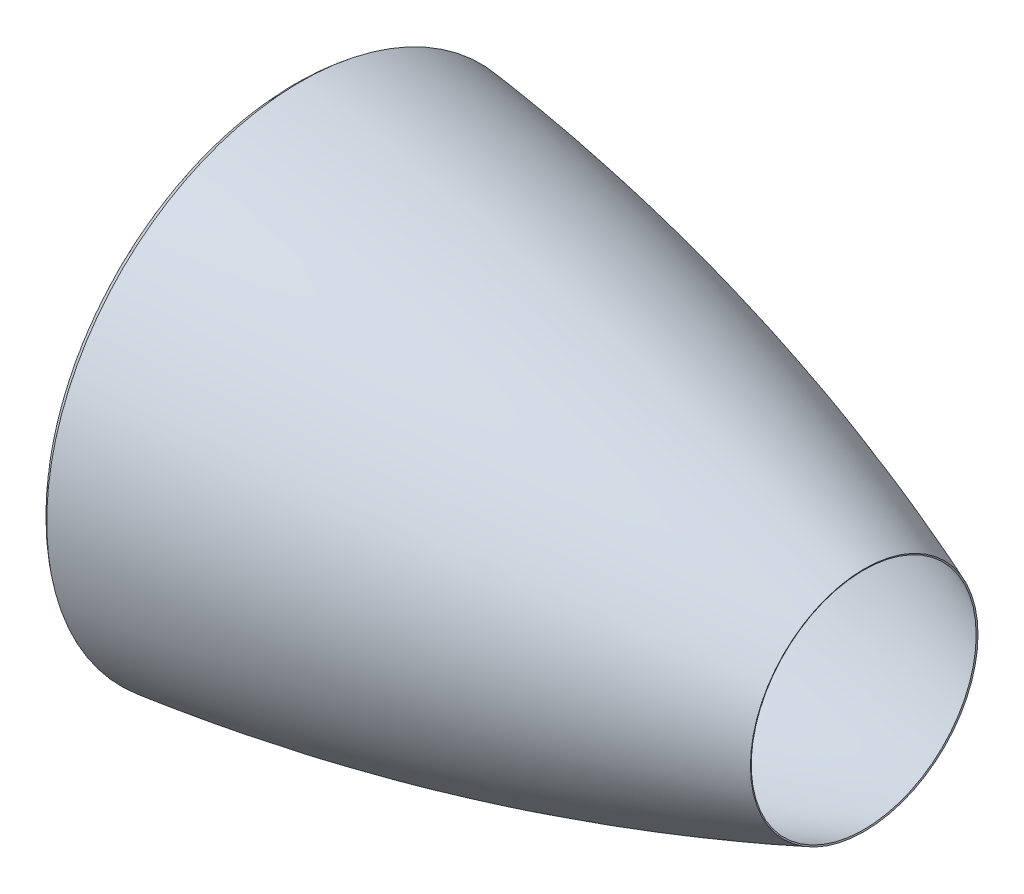
ISO-10303-21;
HEADER;
FILE_DESCRIPTION(('STEP AP214'),'2;1');
FILE_NAME('part.step','',(''),(''),'','','');
FILE_SCHEMA(('AUTOMOTIVE_DESIGN { 1 0 10303 214 1 1 1 1 }'));
ENDSEC;
DATA;
#1=APPLICATION_CONTEXT('core data for automotive mechanical design processes');
#2=APPLICATION_PROTOCOL_DEFINITION('international standard','automotive_design',2000,#1);
#3=PRODUCT_CONTEXT('',#1,'mechanical');
#4=PRODUCT('Part','Part','',(#3));
#5=PRODUCT_RELATED_PRODUCT_CATEGORY('part','',(#4));
#6=PRODUCT_DEFINITION_FORMATION('','',#4);
#7=PRODUCT_DEFINITION_CONTEXT('part definition',#1,'design');
#8=PRODUCT_DEFINITION('design','',#6,#7);
#9=PRODUCT_DEFINITION_SHAPE('','',#8);
#10=(LENGTH_UNIT() NAMED_UNIT(*) SI_UNIT(.MILLI.,.METRE.));
#11=(NAMED_UNIT(*) PLANE_ANGLE_UNIT() SI_UNIT($,.RADIAN.));
#12=(NAMED_UNIT(*) SI_UNIT($,.STERADIAN.) SOLID_ANGLE_UNIT());
#13=UNCERTAINTY_MEASURE_WITH_UNIT(LENGTH_MEASURE(1.E-05),#10,'distance_accuracy_value','');
#14=(GEOMETRIC_REPRESENTATION_CONTEXT(3) GLOBAL_UNCERTAINTY_ASSIGNED_CONTEXT((#13)) GLOBAL_UNIT_ASSIGNED_CONTEXT((#10,
#11,#12)) REPRESENTATION_CONTEXT('',''));
#15=CARTESIAN_POINT('',(0.,0.,0.));
#16=DIRECTION('',(0.,0.,1.));
#17=DIRECTION('',(1.,0.,0.));
#18=AXIS2_PLACEMENT_3D('',#15,#16,#17);
#19=CARTESIAN_POINT('',(71.0704075556571,0.,0.));
#20=DIRECTION('',(-1.,0.,0.));
#21=DIRECTION('',(0.,0.,1.));
#22=AXIS2_PLACEMENT_3D('',#19,#20,#21);
#23=PLANE('',#22);
#24=CARTESIAN_POINT('',(71.0704075556571,0.,0.));
#25=DIRECTION('',(1.,0.,0.));
#26=DIRECTION('',(0.,0.,-1.));
#27=AXIS2_PLACEMENT_3D('',#24,#25,#26);
#28=CIRCLE('',#27,845.);
#29=CARTESIAN_POINT('',(71.0704075556571,0.,-845.));
#30=VERTEX_POINT('',#29);
#31=EDGE_CURVE('E51',#30,#30,#28,.T.);
#32=ORIENTED_EDGE('',*,*,#31,.F.);
#33=EDGE_LOOP('',(#32));
#34=FACE_BOUND('',#33,.T.);
#35=CARTESIAN_POINT('',(71.0704075556571,0.,0.));
#36=DIRECTION('',(1.,0.,0.));
#37=DIRECTION('',(0.,0.,-1.));
#38=AXIS2_PLACEMENT_3D('',#35,#36,#37);
#39=CIRCLE('',#38,850.);
#40=CARTESIAN_POINT('',(71.0704075556571,0.,-850.));
#41=VERTEX_POINT('',#40);
#42=EDGE_CURVE('E114',#41,#41,#39,.T.);
#43=ORIENTED_EDGE('',*,*,#42,.T.);
#44=EDGE_LOOP('',(#43));
#45=FACE_BOUND('',#44,.T.);
#46=ADVANCED_FACE('F33',(#34,#45),#23,.F.);
#47=CARTESIAN_POINT('',(2000.,0.,0.));
#48=DIRECTION('',(1.,0.,0.));
#49=DIRECTION('',(0.,0.,-1.));
#50=AXIS2_PLACEMENT_3D('',#47,#48,#49);
#51=CONICAL_SURFACE('',#50,400.,1.19713194387425);
#52=CARTESIAN_POINT('',(2001.82514700446,0.,0.));
#53=DIRECTION('',(1.,0.,0.));
#54=DIRECTION('',(0.,1.,0.));
#55=AXIS2_PLACEMENT_3D('',#52,#53,#54);
#56=CIRCLE('',#55,404.654979958294);
#57=CARTESIAN_POINT('',(2001.82514700446,404.654979958294,0.));
#58=VERTEX_POINT('',#57);
#59=EDGE_CURVE('E10',#58,#58,#56,.T.);
#60=ORIENTED_EDGE('',*,*,#59,.T.);
#61=EDGE_LOOP('',(#60));
#62=FACE_BOUND('',#61,.T.);
#63=CARTESIAN_POINT('',(2000.,0.,0.));
#64=DIRECTION('',(1.,0.,0.));
#65=DIRECTION('',(0.,0.,-1.));
#66=AXIS2_PLACEMENT_3D('',#63,#64,#65);
#67=CIRCLE('',#66,400.);
#68=CARTESIAN_POINT('',(2000.,0.,-400.));
#69=VERTEX_POINT('',#68);
#70=EDGE_CURVE('E36',#69,#69,#67,.T.);
#71=ORIENTED_EDGE('',*,*,#70,.F.);
#72=EDGE_LOOP('',(#71));
#73=FACE_BOUND('',#72,.T.);
#74=ADVANCED_FACE('F150',(#62,#73),#51,.F.);
#75=CARTESIAN_POINT('',(2000.,400.,0.));
#76=CARTESIAN_POINT('',(1027.01771949389,781.491587625774,0.));
#77=CARTESIAN_POINT('',(-10.2701771949389,900.034658820857,0.));
#78=CARTESIAN_POINT('',(-20.5403543898779,901.208352595066,0.));
#79=B_SPLINE_CURVE_WITH_KNOTS('',2,(#75,#76,#77,#78),.UNSPECIFIED.,.F.,.F.,(3,1,3),(0.,1.,1.01),.UNSPECIFIED.);
#80=CARTESIAN_POINT('',(0.,0.,0.));
#81=DIRECTION('',(1.,0.,0.));
#82=AXIS1_PLACEMENT('',#80,#81);
#83=SURFACE_OF_REVOLUTION('',#79,#82);
#84=OFFSET_SURFACE('',#83,-5.,.F.);
#85=CARTESIAN_POINT('',(-1.420548202098,0.,0.));
#86=DIRECTION('',(1.,0.,0.));
#87=DIRECTION('',(0.,0.,-1.));
#88=AXIS2_PLACEMENT_3D('',#85,#86,#87);
#89=CIRCLE('',#88,904.055852650809);
#90=CARTESIAN_POINT('',(-1.420548202098,0.,-904.055852650809));
#91=VERTEX_POINT('',#90);
#92=EDGE_CURVE('E40',#91,#91,#89,.T.);
#93=ORIENTED_EDGE('',*,*,#92,.T.);
#94=EDGE_LOOP('',(#93));
#95=FACE_BOUND('',#94,.T.);
#96=ORIENTED_EDGE('',*,*,#59,.F.);
#97=EDGE_LOOP('',(#96));
#98=FACE_BOUND('',#97,.T.);
#99=ADVANCED_FACE('F70',(#95,#98),#84,.F.);
#100=CARTESIAN_POINT('',(1.59597979113481,900.068302166358,0.));
#101=CARTESIAN_POINT('',(0.797989895567405,899.464633606503,0.));
#102=CARTESIAN_POINT('',(-61.9092493186176,852.027455517963,0.));
#103=CARTESIAN_POINT('',(0.619092493186176,829.77972544482,0.));
#104=CARTESIAN_POINT('',(1.23818498637235,829.559450889641,0.));
#105=B_SPLINE_CURVE_WITH_KNOTS('',2,(#100,#101,#102,#103,#104),.UNSPECIFIED.,.F.,.F.,(3,1,1,3),
(-0.0128896716460012,0.,1.,1.01),.UNSPECIFIED.);
#106=CARTESIAN_POINT('',(0.,0.,0.));
#107=DIRECTION('',(1.,0.,0.));
#108=AXIS1_PLACEMENT('',#106,#107);
#109=SURFACE_OF_REVOLUTION('',#105,#108);
#110=OFFSET_SURFACE('',#109,-5.,.F.);
#111=CARTESIAN_POINT('',(-0.863006392076815,0.,0.));
#112=DIRECTION('',(1.,0.,0.));
#113=DIRECTION('',(0.,0.,-1.));
#114=AXIS2_PLACEMENT_3D('',#111,#112,#113);
#115=CIRCLE('',#114,825.);
#116=CARTESIAN_POINT('',(-0.863006392076815,0.,-825.));
#117=VERTEX_POINT('',#116);
#118=EDGE_CURVE('E45',#117,#117,#115,.T.);
#119=ORIENTED_EDGE('',*,*,#118,.T.);
#120=EDGE_LOOP('',(#119));
#121=FACE_BOUND('',#120,.T.);
#122=ORIENTED_EDGE('',*,*,#92,.F.);
#123=EDGE_LOOP('',(#122));
#124=FACE_BOUND('',#123,.T.);
#125=ADVANCED_FACE('F71',(#121,#124),#110,.F.);
#126=CARTESIAN_POINT('',(0.,0.,0.));
#127=DIRECTION('',(1.,0.,0.));
#128=DIRECTION('',(0.,0.,-1.));
#129=AXIS2_PLACEMENT_3D('',#126,#127,#128);
#130=CYLINDRICAL_SURFACE('',#129,825.);
#131=CARTESIAN_POINT('',(26.9951544514907,0.,0.));
#132=DIRECTION('',(1.,0.,0.));
#133=DIRECTION('',(0.,0.,-1.));
#134=AXIS2_PLACEMENT_3D('',#131,#132,#133);
#135=CIRCLE('',#134,825.);
#136=CARTESIAN_POINT('',(26.9951544514907,0.,-825.));
#137=VERTEX_POINT('',#136);
#138=EDGE_CURVE('E54',#137,#137,#135,.T.);
#139=ORIENTED_EDGE('',*,*,#138,.T.);
#140=EDGE_LOOP('',(#139));
#141=FACE_BOUND('',#140,.T.);
#142=ORIENTED_EDGE('',*,*,#118,.F.);
#143=EDGE_LOOP('',(#142));
#144=FACE_BOUND('',#143,.T.);
#145=ADVANCED_FACE('F74',(#141,#144),#130,.F.);
#146=CARTESIAN_POINT('',(28.4422192936471,0.,0.));
#147=DIRECTION('',(1.,0.,0.));
#148=DIRECTION('',(0.,0.,-1.));
#149=AXIS2_PLACEMENT_3D('',#146,#147,#148);
#150=CONICAL_SURFACE('',#149,826.373551829345,0.759341317263716);
#151=CARTESIAN_POINT('',(48.0655620071478,0.,0.));
#152=DIRECTION('',(1.,0.,0.));
#153=DIRECTION('',(0.,0.,-1.));
#154=AXIS2_PLACEMENT_3D('',#151,#152,#153);
#155=CIRCLE('',#154,845.);
#156=CARTESIAN_POINT('',(48.0655620071478,0.,-845.));
#157=VERTEX_POINT('',#156);
#158=EDGE_CURVE('E49',#157,#157,#155,.T.);
#159=ORIENTED_EDGE('',*,*,#158,.T.);
#160=EDGE_LOOP('',(#159));
#161=FACE_BOUND('',#160,.T.);
#162=ORIENTED_EDGE('',*,*,#138,.F.);
#163=EDGE_LOOP('',(#162));
#164=FACE_BOUND('',#163,.T.);
#165=ADVANCED_FACE('F80',(#161,#164),#150,.F.);
#166=CARTESIAN_POINT('',(0.,0.,0.));
#167=DIRECTION('',(1.,0.,0.));
#168=DIRECTION('',(0.,0.,-1.));
#169=AXIS2_PLACEMENT_3D('',#166,#167,#168);
#170=CYLINDRICAL_SURFACE('',#169,845.);
#171=ORIENTED_EDGE('',*,*,#31,.T.);
#172=EDGE_LOOP('',(#171));
#173=FACE_BOUND('',#172,.T.);
#174=ORIENTED_EDGE('',*,*,#158,.F.);
#175=EDGE_LOOP('',(#174));
#176=FACE_BOUND('',#175,.T.);
#177=ADVANCED_FACE('F84',(#173,#176),#170,.F.);
#178=CARTESIAN_POINT('',(2000.,400.,0.));
#179=CARTESIAN_POINT('',(1027.01771949389,781.491587625774,0.));
#180=CARTESIAN_POINT('',(0.,898.860965046649,0.));
#181=B_SPLINE_CURVE_WITH_KNOTS('',2,(#178,#179,#180),.UNSPECIFIED.,.F.,.F.,(3,3),(0.,1.),.UNSPECIFIED.);
#182=CARTESIAN_POINT('',(0.,0.,0.));
#183=DIRECTION('',(1.,0.,0.));
#184=AXIS1_PLACEMENT('',#182,#183);
#185=SURFACE_OF_REVOLUTION('',#181,#184);
#186=CARTESIAN_POINT('',(0.,0.,0.));
#187=DIRECTION('',(1.,0.,0.));
#188=DIRECTION('',(0.,0.,-1.));
#189=AXIS2_PLACEMENT_3D('',#186,#187,#188);
#190=CIRCLE('',#189,898.860965046649);
#191=CARTESIAN_POINT('',(0.,0.,-898.860965046649));
#192=VERTEX_POINT('',#191);
#193=EDGE_CURVE('E128',#192,#192,#190,.T.);
#194=ORIENTED_EDGE('',*,*,#193,.F.);
#195=EDGE_LOOP('',(#194));
#196=FACE_BOUND('',#195,.T.);
#197=ORIENTED_EDGE('',*,*,#70,.T.);
#198=EDGE_LOOP('',(#197));
#199=FACE_BOUND('',#198,.T.);
#200=ADVANCED_FACE('F88',(#196,#199),#185,.T.);
#201=CARTESIAN_POINT('',(0.,898.860965046649,0.));
#202=CARTESIAN_POINT('',(-61.9092493186176,852.027455517963,0.));
#203=CARTESIAN_POINT('',(0.,830.,0.));
#204=B_SPLINE_CURVE_WITH_KNOTS('',2,(#201,#202,#203),.UNSPECIFIED.,.F.,.F.,(3,3),(0.,1.),.UNSPECIFIED.);
#205=CARTESIAN_POINT('',(0.,0.,0.));
#206=DIRECTION('',(1.,0.,0.));
#207=AXIS1_PLACEMENT('',#205,#206);
#208=SURFACE_OF_REVOLUTION('',#204,#207);
#209=CARTESIAN_POINT('',(0.,0.,0.));
#210=DIRECTION('',(1.,0.,0.));
#211=DIRECTION('',(0.,0.,-1.));
#212=AXIS2_PLACEMENT_3D('',#209,#210,#211);
#213=CIRCLE('',#212,830.);
#214=CARTESIAN_POINT('',(0.,0.,-830.));
#215=VERTEX_POINT('',#214);
#216=EDGE_CURVE('E126',#215,#215,#213,.T.);
#217=ORIENTED_EDGE('',*,*,#216,.F.);
#218=EDGE_LOOP('',(#217));
#219=FACE_BOUND('',#218,.T.);
#220=ORIENTED_EDGE('',*,*,#193,.T.);
#221=EDGE_LOOP('',(#220));
#222=FACE_BOUND('',#221,.T.);
#223=ADVANCED_FACE('F101',(#219,#222),#208,.T.);
#224=CARTESIAN_POINT('',(0.,0.,0.));
#225=DIRECTION('',(1.,0.,0.));
#226=DIRECTION('',(0.,0.,-1.));
#227=AXIS2_PLACEMENT_3D('',#224,#225,#226);
#228=CYLINDRICAL_SURFACE('',#227,830.);
#229=CARTESIAN_POINT('',(25.,0.,0.));
#230=DIRECTION('',(1.,0.,0.));
#231=DIRECTION('',(0.,0.,-1.));
#232=AXIS2_PLACEMENT_3D('',#229,#230,#231);
#233=CIRCLE('',#232,830.);
#234=CARTESIAN_POINT('',(25.,0.,-830.));
#235=VERTEX_POINT('',#234);
#236=EDGE_CURVE('E120',#235,#235,#233,.T.);
#237=ORIENTED_EDGE('',*,*,#236,.F.);
#238=EDGE_LOOP('',(#237));
#239=FACE_BOUND('',#238,.T.);
#240=ORIENTED_EDGE('',*,*,#216,.T.);
#241=EDGE_LOOP('',(#240));
#242=FACE_BOUND('',#241,.T.);
#243=ADVANCED_FACE('F97',(#239,#242),#228,.T.);
#244=CARTESIAN_POINT('',(25.,0.,0.));
#245=DIRECTION('',(1.,0.,0.));
#246=DIRECTION('',(0.,0.,-1.));
#247=AXIS2_PLACEMENT_3D('',#244,#245,#246);
#248=CONICAL_SURFACE('',#247,830.,0.759341317263716);
#249=CARTESIAN_POINT('',(46.0704075556571,0.,0.));
#250=DIRECTION('',(1.,0.,0.));
#251=DIRECTION('',(0.,0.,-1.));
#252=AXIS2_PLACEMENT_3D('',#249,#250,#251);
#253=CIRCLE('',#252,850.);
#254=CARTESIAN_POINT('',(46.0704075556571,0.,-850.));
#255=VERTEX_POINT('',#254);
#256=EDGE_CURVE('E121',#255,#255,#253,.T.);
#257=ORIENTED_EDGE('',*,*,#256,.F.);
#258=EDGE_LOOP('',(#257));
#259=FACE_BOUND('',#258,.T.);
#260=ORIENTED_EDGE('',*,*,#236,.T.);
#261=EDGE_LOOP('',(#260));
#262=FACE_BOUND('',#261,.T.);
#263=ADVANCED_FACE('F93',(#259,#262),#248,.T.);
#264=CARTESIAN_POINT('',(0.,0.,0.));
#265=DIRECTION('',(1.,0.,0.));
#266=DIRECTION('',(0.,0.,-1.));
#267=AXIS2_PLACEMENT_3D('',#264,#265,#266);
#268=CYLINDRICAL_SURFACE('',#267,850.);
#269=ORIENTED_EDGE('',*,*,#42,.F.);
#270=EDGE_LOOP('',(#269));
#271=FACE_BOUND('',#270,.T.);
#272=ORIENTED_EDGE('',*,*,#256,.T.);
#273=EDGE_LOOP('',(#272));
#274=FACE_BOUND('',#273,.T.);
#275=ADVANCED_FACE('F90',(#271,#274),#268,.T.);
#276=CLOSED_SHELL('',(#46,#74,#99,#125,#145,#165,#177,#200,#223,#243,#263,#275));
#277=MANIFOLD_SOLID_BREP('B2',#276);
#278=ADVANCED_BREP_SHAPE_REPRESENTATION('',(#18,#277),#14);
#279=SHAPE_DEFINITION_REPRESENTATION(#9,#278);
ENDSEC;
END-ISO-10303-21;
